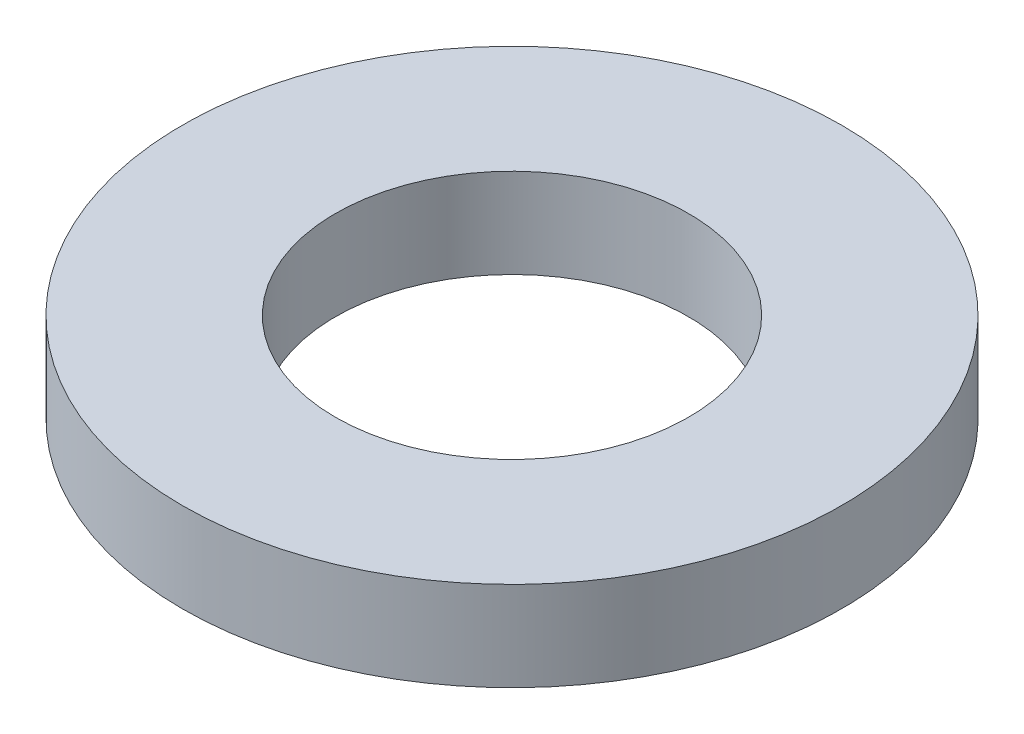
ISO-10303-21;
HEADER;
FILE_DESCRIPTION(('STEP AP214'),'2;1');
FILE_NAME('part.step','',(''),(''),'','','');
FILE_SCHEMA(('AUTOMOTIVE_DESIGN { 1 0 10303 214 1 1 1 1 }'));
ENDSEC;
DATA;
#1=APPLICATION_CONTEXT('core data for automotive mechanical design processes');
#2=APPLICATION_PROTOCOL_DEFINITION('international standard','automotive_design',2000,#1);
#3=PRODUCT_CONTEXT('',#1,'mechanical');
#4=PRODUCT('Part','Part','',(#3));
#5=PRODUCT_RELATED_PRODUCT_CATEGORY('part','',(#4));
#6=PRODUCT_DEFINITION_FORMATION('','',#4);
#7=PRODUCT_DEFINITION_CONTEXT('part definition',#1,'design');
#8=PRODUCT_DEFINITION('design','',#6,#7);
#9=PRODUCT_DEFINITION_SHAPE('','',#8);
#10=(LENGTH_UNIT() NAMED_UNIT(*) SI_UNIT(.MILLI.,.METRE.));
#11=(NAMED_UNIT(*) PLANE_ANGLE_UNIT() SI_UNIT($,.RADIAN.));
#12=(NAMED_UNIT(*) SI_UNIT($,.STERADIAN.) SOLID_ANGLE_UNIT());
#13=UNCERTAINTY_MEASURE_WITH_UNIT(LENGTH_MEASURE(1.E-05),#10,'distance_accuracy_value','');
#14=(GEOMETRIC_REPRESENTATION_CONTEXT(3) GLOBAL_UNCERTAINTY_ASSIGNED_CONTEXT((#13)) GLOBAL_UNIT_ASSIGNED_CONTEXT((#10,
#11,#12)) REPRESENTATION_CONTEXT('',''));
#15=CARTESIAN_POINT('',(0.,0.,0.));
#16=DIRECTION('',(0.,0.,1.));
#17=DIRECTION('',(1.,0.,0.));
#18=AXIS2_PLACEMENT_3D('',#15,#16,#17);
#19=CARTESIAN_POINT('',(0.,19.,0.));
#20=DIRECTION('',(0.,-1.,0.));
#21=DIRECTION('',(0.,0.,-1.));
#22=AXIS2_PLACEMENT_3D('',#19,#20,#21);
#23=CYLINDRICAL_SURFACE('',#22,70.);
#24=CARTESIAN_POINT('',(0.,19.,0.));
#25=DIRECTION('',(0.,1.,0.));
#26=DIRECTION('',(0.,0.,1.));
#27=AXIS2_PLACEMENT_3D('',#24,#25,#26);
#28=CIRCLE('',#27,70.);
#29=CARTESIAN_POINT('',(0.,19.,70.));
#30=VERTEX_POINT('',#29);
#31=EDGE_CURVE('E10',#30,#30,#28,.T.);
#32=ORIENTED_EDGE('',*,*,#31,.F.);
#33=EDGE_LOOP('',(#32));
#34=FACE_BOUND('',#33,.T.);
#35=CARTESIAN_POINT('',(0.,0.,0.));
#36=DIRECTION('',(0.,1.,0.));
#37=DIRECTION('',(0.,0.,1.));
#38=AXIS2_PLACEMENT_3D('',#35,#36,#37);
#39=CIRCLE('',#38,70.);
#40=CARTESIAN_POINT('',(0.,0.,70.));
#41=VERTEX_POINT('',#40);
#42=EDGE_CURVE('E37',#41,#41,#39,.T.);
#43=ORIENTED_EDGE('',*,*,#42,.T.);
#44=EDGE_LOOP('',(#43));
#45=FACE_BOUND('',#44,.T.);
#46=ADVANCED_FACE('F40',(#34,#45),#23,.T.);
#47=CARTESIAN_POINT('',(0.,19.,0.));
#48=DIRECTION('',(0.,1.,0.));
#49=DIRECTION('',(0.,0.,1.));
#50=AXIS2_PLACEMENT_3D('',#47,#48,#49);
#51=PLANE('',#50);
#52=CARTESIAN_POINT('',(0.,19.,0.));
#53=DIRECTION('',(0.,1.,0.));
#54=DIRECTION('',(0.,0.,1.));
#55=AXIS2_PLACEMENT_3D('',#52,#53,#54);
#56=CIRCLE('',#55,37.5);
#57=CARTESIAN_POINT('',(0.,19.,37.5));
#58=VERTEX_POINT('',#57);
#59=EDGE_CURVE('E50',#58,#58,#56,.T.);
#60=ORIENTED_EDGE('',*,*,#59,.F.);
#61=EDGE_LOOP('',(#60));
#62=FACE_BOUND('',#61,.T.);
#63=ORIENTED_EDGE('',*,*,#31,.T.);
#64=EDGE_LOOP('',(#63));
#65=FACE_BOUND('',#64,.T.);
#66=ADVANCED_FACE('F59',(#62,#65),#51,.T.);
#67=CARTESIAN_POINT('',(0.,0.,0.));
#68=DIRECTION('',(0.,1.,0.));
#69=DIRECTION('',(0.,0.,1.));
#70=AXIS2_PLACEMENT_3D('',#67,#68,#69);
#71=PLANE('',#70);
#72=CARTESIAN_POINT('',(0.,0.,0.));
#73=DIRECTION('',(0.,1.,0.));
#74=DIRECTION('',(0.,0.,1.));
#75=AXIS2_PLACEMENT_3D('',#72,#73,#74);
#76=CIRCLE('',#75,37.5);
#77=CARTESIAN_POINT('',(0.,0.,37.5));
#78=VERTEX_POINT('',#77);
#79=EDGE_CURVE('E47',#78,#78,#76,.T.);
#80=ORIENTED_EDGE('',*,*,#79,.T.);
#81=EDGE_LOOP('',(#80));
#82=FACE_BOUND('',#81,.T.);
#83=ORIENTED_EDGE('',*,*,#42,.F.);
#84=EDGE_LOOP('',(#83));
#85=FACE_BOUND('',#84,.T.);
#86=ADVANCED_FACE('F58',(#82,#85),#71,.F.);
#87=CARTESIAN_POINT('',(0.,19.,0.));
#88=DIRECTION('',(0.,-1.,0.));
#89=DIRECTION('',(0.,0.,-1.));
#90=AXIS2_PLACEMENT_3D('',#87,#88,#89);
#91=CYLINDRICAL_SURFACE('',#90,37.5);
#92=ORIENTED_EDGE('',*,*,#59,.T.);
#93=EDGE_LOOP('',(#92));
#94=FACE_BOUND('',#93,.T.);
#95=ORIENTED_EDGE('',*,*,#79,.F.);
#96=EDGE_LOOP('',(#95));
#97=FACE_BOUND('',#96,.T.);
#98=ADVANCED_FACE('F54',(#94,#97),#91,.F.);
#99=CLOSED_SHELL('',(#46,#66,#86,#98));
#100=MANIFOLD_SOLID_BREP('B2',#99);
#101=ADVANCED_BREP_SHAPE_REPRESENTATION('',(#18,#100),#14);
#102=SHAPE_DEFINITION_REPRESENTATION(#9,#101);
ENDSEC;
END-ISO-10303-21;
